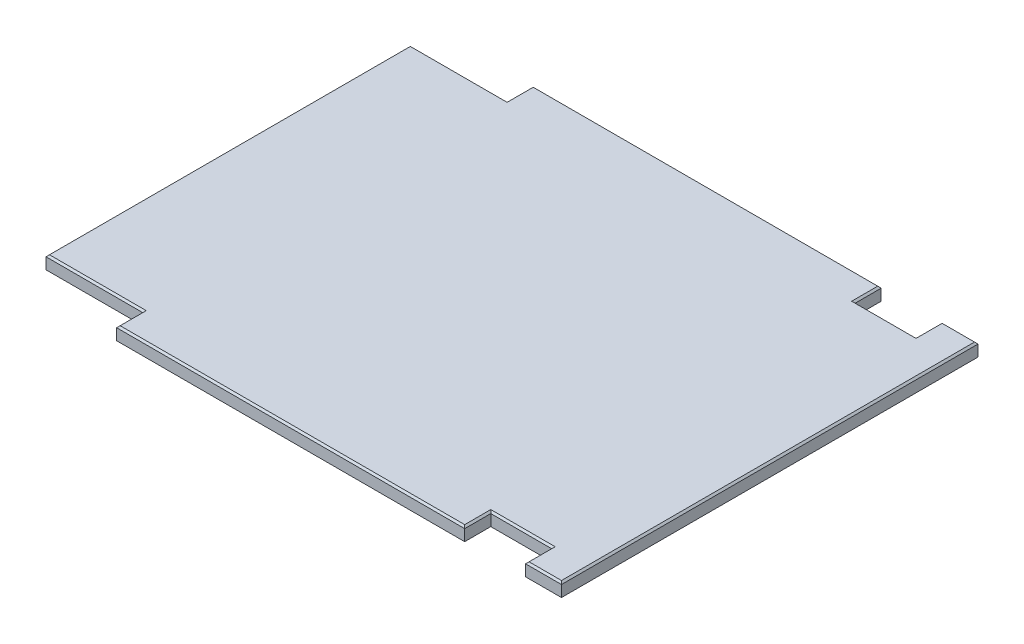
ISO-10303-21;
HEADER;
FILE_DESCRIPTION(('STEP AP214'),'2;1');
FILE_NAME('part.step','',(''),(''),'','','');
FILE_SCHEMA(('AUTOMOTIVE_DESIGN { 1 0 10303 214 1 1 1 1 }'));
ENDSEC;
DATA;
#1=APPLICATION_CONTEXT('core data for automotive mechanical design processes');
#2=APPLICATION_PROTOCOL_DEFINITION('international standard','automotive_design',2000,#1);
#3=PRODUCT_CONTEXT('',#1,'mechanical');
#4=PRODUCT('Part','Part','',(#3));
#5=PRODUCT_RELATED_PRODUCT_CATEGORY('part','',(#4));
#6=PRODUCT_DEFINITION_FORMATION('','',#4);
#7=PRODUCT_DEFINITION_CONTEXT('part definition',#1,'design');
#8=PRODUCT_DEFINITION('design','',#6,#7);
#9=PRODUCT_DEFINITION_SHAPE('','',#8);
#10=(LENGTH_UNIT() NAMED_UNIT(*) SI_UNIT(.MILLI.,.METRE.));
#11=(NAMED_UNIT(*) PLANE_ANGLE_UNIT() SI_UNIT($,.RADIAN.));
#12=(NAMED_UNIT(*) SI_UNIT($,.STERADIAN.) SOLID_ANGLE_UNIT());
#13=UNCERTAINTY_MEASURE_WITH_UNIT(LENGTH_MEASURE(1.E-05),#10,'distance_accuracy_value','');
#14=(GEOMETRIC_REPRESENTATION_CONTEXT(3) GLOBAL_UNCERTAINTY_ASSIGNED_CONTEXT((#13)) GLOBAL_UNIT_ASSIGNED_CONTEXT((#10,
#11,#12)) REPRESENTATION_CONTEXT('',''));
#15=CARTESIAN_POINT('',(0.,0.,0.));
#16=DIRECTION('',(0.,0.,1.));
#17=DIRECTION('',(1.,0.,0.));
#18=AXIS2_PLACEMENT_3D('',#15,#16,#17);
#19=CARTESIAN_POINT('',(0.,19.05,0.));
#20=DIRECTION('',(0.,0.,-1.));
#21=DIRECTION('',(-1.,0.,0.));
#22=AXIS2_PLACEMENT_3D('',#19,#20,#21);
#23=PLANE('',#22);
#24=DIRECTION('',(0.,-1.,0.));
#25=VECTOR('',#24,1.);
#26=CARTESIAN_POINT('',(790.575,19.05,0.));
#27=LINE('',#26,#25);
#28=CARTESIAN_POINT('',(790.575,16.51,0.));
#29=VERTEX_POINT('',#28);
#30=CARTESIAN_POINT('',(790.575,0.,0.));
#31=VERTEX_POINT('',#30);
#32=EDGE_CURVE('E243',#29,#31,#27,.T.);
#33=ORIENTED_EDGE('',*,*,#32,.F.);
#34=DIRECTION('',(-1.,0.,0.));
#35=VECTOR('',#34,1.);
#36=CARTESIAN_POINT('',(0.,16.51,0.));
#37=LINE('',#36,#35);
#38=CARTESIAN_POINT('',(738.1875,16.51,0.));
#39=VERTEX_POINT('',#38);
#40=EDGE_CURVE('E65',#29,#39,#37,.T.);
#41=ORIENTED_EDGE('',*,*,#40,.T.);
#42=DIRECTION('',(0.,1.,0.));
#43=VECTOR('',#42,1.);
#44=CARTESIAN_POINT('',(738.1875,0.,0.));
#45=LINE('',#44,#43);
#46=CARTESIAN_POINT('',(738.1875,0.,0.));
#47=VERTEX_POINT('',#46);
#48=EDGE_CURVE('E356',#47,#39,#45,.T.);
#49=ORIENTED_EDGE('',*,*,#48,.F.);
#50=DIRECTION('',(1.,0.,0.));
#51=VECTOR('',#50,1.);
#52=CARTESIAN_POINT('',(0.,0.,0.));
#53=LINE('',#52,#51);
#54=EDGE_CURVE('E395',#47,#31,#53,.T.);
#55=ORIENTED_EDGE('',*,*,#54,.T.);
#56=EDGE_LOOP('',(#33,#41,#49,#55));
#57=FACE_BOUND('',#56,.T.);
#58=ADVANCED_FACE('F40',(#57),#23,.F.);
#59=CARTESIAN_POINT('',(0.,19.05,-608.0125));
#60=DIRECTION('',(0.,0.,1.));
#61=DIRECTION('',(1.,0.,0.));
#62=AXIS2_PLACEMENT_3D('',#59,#60,#61);
#63=PLANE('',#62);
#64=DIRECTION('',(0.,1.,0.));
#65=VECTOR('',#64,1.);
#66=CARTESIAN_POINT('',(738.1875,0.,-608.0125));
#67=LINE('',#66,#65);
#68=CARTESIAN_POINT('',(738.1875,0.,-608.0125));
#69=VERTEX_POINT('',#68);
#70=CARTESIAN_POINT('',(738.1875,16.51,-608.0125));
#71=VERTEX_POINT('',#70);
#72=EDGE_CURVE('E383',#69,#71,#67,.T.);
#73=ORIENTED_EDGE('',*,*,#72,.T.);
#74=DIRECTION('',(1.,0.,0.));
#75=VECTOR('',#74,1.);
#76=CARTESIAN_POINT('',(0.,16.51,-608.0125));
#77=LINE('',#76,#75);
#78=CARTESIAN_POINT('',(790.575,16.51,-608.0125));
#79=VERTEX_POINT('',#78);
#80=EDGE_CURVE('E300',#71,#79,#77,.T.);
#81=ORIENTED_EDGE('',*,*,#80,.T.);
#82=DIRECTION('',(0.,-1.,0.));
#83=VECTOR('',#82,1.);
#84=CARTESIAN_POINT('',(790.575,19.05,-608.0125));
#85=LINE('',#84,#83);
#86=CARTESIAN_POINT('',(790.575,0.,-608.0125));
#87=VERTEX_POINT('',#86);
#88=EDGE_CURVE('E236',#79,#87,#85,.T.);
#89=ORIENTED_EDGE('',*,*,#88,.T.);
#90=DIRECTION('',(-1.,0.,0.));
#91=VECTOR('',#90,1.);
#92=CARTESIAN_POINT('',(0.,0.,-608.0125));
#93=LINE('',#92,#91);
#94=EDGE_CURVE('E232',#87,#69,#93,.T.);
#95=ORIENTED_EDGE('',*,*,#94,.T.);
#96=EDGE_LOOP('',(#73,#81,#89,#95));
#97=FACE_BOUND('',#96,.T.);
#98=ADVANCED_FACE('F469',(#97),#63,.F.);
#99=CARTESIAN_POINT('',(0.,19.05,0.));
#100=DIRECTION('',(1.,0.,0.));
#101=DIRECTION('',(0.,0.,-1.));
#102=AXIS2_PLACEMENT_3D('',#99,#100,#101);
#103=PLANE('',#102);
#104=DIRECTION('',(0.,1.,0.));
#105=VECTOR('',#104,1.);
#106=CARTESIAN_POINT('',(0.,0.,-38.1000000000009));
#107=LINE('',#106,#105);
#108=CARTESIAN_POINT('',(0.,0.,-38.1000000000009));
#109=VERTEX_POINT('',#108);
#110=CARTESIAN_POINT('',(0.,16.51,-38.1000000000009));
#111=VERTEX_POINT('',#110);
#112=EDGE_CURVE('E374',#109,#111,#107,.T.);
#113=ORIENTED_EDGE('',*,*,#112,.T.);
#114=DIRECTION('',(0.,0.,-1.));
#115=VECTOR('',#114,1.);
#116=CARTESIAN_POINT('',(0.,16.51,0.));
#117=LINE('',#116,#115);
#118=CARTESIAN_POINT('',(0.,16.51,-569.912499999999));
#119=VERTEX_POINT('',#118);
#120=EDGE_CURVE('E287',#111,#119,#117,.T.);
#121=ORIENTED_EDGE('',*,*,#120,.T.);
#122=DIRECTION('',(0.,1.,0.));
#123=VECTOR('',#122,1.);
#124=CARTESIAN_POINT('',(0.,0.,-569.912499999999));
#125=LINE('',#124,#123);
#126=CARTESIAN_POINT('',(0.,0.,-569.912499999999));
#127=VERTEX_POINT('',#126);
#128=EDGE_CURVE('E226',#127,#119,#125,.T.);
#129=ORIENTED_EDGE('',*,*,#128,.F.);
#130=DIRECTION('',(0.,0.,1.));
#131=VECTOR('',#130,1.);
#132=CARTESIAN_POINT('',(0.,0.,0.));
#133=LINE('',#132,#131);
#134=EDGE_CURVE('E387',#127,#109,#133,.T.);
#135=ORIENTED_EDGE('',*,*,#134,.T.);
#136=EDGE_LOOP('',(#113,#121,#129,#135));
#137=FACE_BOUND('',#136,.T.);
#138=ADVANCED_FACE('F485',(#137),#103,.F.);
#139=DIRECTION('',(0.,1.,0.));
#140=VECTOR('',#139,1.);
#141=CARTESIAN_POINT('',(649.2875,0.,5.55111512312578E-13));
#142=LINE('',#141,#140);
#143=CARTESIAN_POINT('',(649.2875,0.,0.));
#144=VERTEX_POINT('',#143);
#145=CARTESIAN_POINT('',(649.2875,16.51,5.55111512312578E-13));
#146=VERTEX_POINT('',#145);
#147=EDGE_CURVE('E361',#144,#146,#142,.T.);
#148=ORIENTED_EDGE('',*,*,#147,.T.);
#149=DIRECTION('',(-1.,0.,0.));
#150=VECTOR('',#149,1.);
#151=CARTESIAN_POINT('',(0.,16.51,0.));
#152=LINE('',#151,#150);
#153=CARTESIAN_POINT('',(141.2875,16.51,1.11022302462516E-13));
#154=VERTEX_POINT('',#153);
#155=EDGE_CURVE('E281',#146,#154,#152,.T.);
#156=ORIENTED_EDGE('',*,*,#155,.T.);
#157=DIRECTION('',(0.,1.,0.));
#158=VECTOR('',#157,1.);
#159=CARTESIAN_POINT('',(141.2875,0.,1.11022302462516E-13));
#160=LINE('',#159,#158);
#161=CARTESIAN_POINT('',(141.2875,0.,1.11022302462516E-13));
#162=VERTEX_POINT('',#161);
#163=EDGE_CURVE('E406',#162,#154,#160,.T.);
#164=ORIENTED_EDGE('',*,*,#163,.F.);
#165=EDGE_CURVE('E238',#162,#144,#53,.T.);
#166=ORIENTED_EDGE('',*,*,#165,.T.);
#167=EDGE_LOOP('',(#148,#156,#164,#166));
#168=FACE_BOUND('',#167,.T.);
#169=ADVANCED_FACE('F404',(#168),#23,.F.);
#170=CARTESIAN_POINT('',(790.575,19.05,0.));
#171=DIRECTION('',(-1.,0.,0.));
#172=DIRECTION('',(0.,0.,1.));
#173=AXIS2_PLACEMENT_3D('',#170,#171,#172);
#174=PLANE('',#173);
#175=ORIENTED_EDGE('',*,*,#88,.F.);
#176=DIRECTION('',(0.,0.,1.));
#177=VECTOR('',#176,1.);
#178=CARTESIAN_POINT('',(790.575,16.51,0.));
#179=LINE('',#178,#177);
#180=EDGE_CURVE('E302',#79,#29,#179,.T.);
#181=ORIENTED_EDGE('',*,*,#180,.T.);
#182=ORIENTED_EDGE('',*,*,#32,.T.);
#183=DIRECTION('',(0.,0.,-1.));
#184=VECTOR('',#183,1.);
#185=CARTESIAN_POINT('',(790.575,0.,0.));
#186=LINE('',#185,#184);
#187=EDGE_CURVE('E233',#31,#87,#186,.T.);
#188=ORIENTED_EDGE('',*,*,#187,.T.);
#189=EDGE_LOOP('',(#175,#181,#182,#188));
#190=FACE_BOUND('',#189,.T.);
#191=ADVANCED_FACE('F475',(#190),#174,.F.);
#192=DIRECTION('',(0.,1.,0.));
#193=VECTOR('',#192,1.);
#194=CARTESIAN_POINT('',(141.2875,0.,-608.0125));
#195=LINE('',#194,#193);
#196=CARTESIAN_POINT('',(141.2875,0.,-608.0125));
#197=VERTEX_POINT('',#196);
#198=CARTESIAN_POINT('',(141.2875,16.51,-608.0125));
#199=VERTEX_POINT('',#198);
#200=EDGE_CURVE('E203',#197,#199,#195,.T.);
#201=ORIENTED_EDGE('',*,*,#200,.T.);
#202=DIRECTION('',(1.,0.,0.));
#203=VECTOR('',#202,1.);
#204=CARTESIAN_POINT('',(0.,16.51,-608.0125));
#205=LINE('',#204,#203);
#206=CARTESIAN_POINT('',(649.2875,16.51,-608.012500000001));
#207=VERTEX_POINT('',#206);
#208=EDGE_CURVE('E292',#199,#207,#205,.T.);
#209=ORIENTED_EDGE('',*,*,#208,.T.);
#210=DIRECTION('',(0.,1.,0.));
#211=VECTOR('',#210,1.);
#212=CARTESIAN_POINT('',(649.2875,0.,-608.012500000001));
#213=LINE('',#212,#211);
#214=CARTESIAN_POINT('',(649.2875,0.,-608.012500000001));
#215=VERTEX_POINT('',#214);
#216=EDGE_CURVE('E231',#215,#207,#213,.T.);
#217=ORIENTED_EDGE('',*,*,#216,.F.);
#218=EDGE_CURVE('E223',#215,#197,#93,.T.);
#219=ORIENTED_EDGE('',*,*,#218,.T.);
#220=EDGE_LOOP('',(#201,#209,#217,#219));
#221=FACE_BOUND('',#220,.T.);
#222=ADVANCED_FACE('F229',(#221),#63,.F.);
#223=CARTESIAN_POINT('',(0.,19.05,0.));
#224=DIRECTION('',(0.,-1.,0.));
#225=DIRECTION('',(0.,0.,-1.));
#226=AXIS2_PLACEMENT_3D('',#223,#224,#225);
#227=PLANE('',#226);
#228=DIRECTION('',(1.,0.,0.));
#229=VECTOR('',#228,1.);
#230=CARTESIAN_POINT('',(0.,19.05,-2.5400000000001));
#231=LINE('',#230,#229);
#232=CARTESIAN_POINT('',(143.8275,19.05,-2.5400000000001));
#233=VERTEX_POINT('',#232);
#234=CARTESIAN_POINT('',(646.7475,19.05,-2.5400000000001));
#235=VERTEX_POINT('',#234);
#236=EDGE_CURVE('E276',#233,#235,#231,.T.);
#237=ORIENTED_EDGE('',*,*,#236,.T.);
#238=DIRECTION('',(0.,0.,-1.));
#239=VECTOR('',#238,1.);
#240=CARTESIAN_POINT('',(646.7475,19.05,0.));
#241=LINE('',#240,#239);
#242=CARTESIAN_POINT('',(646.7475,19.05,-40.6400000000009));
#243=VERTEX_POINT('',#242);
#244=EDGE_CURVE('E278',#235,#243,#241,.T.);
#245=ORIENTED_EDGE('',*,*,#244,.T.);
#246=DIRECTION('',(1.,0.,0.));
#247=VECTOR('',#246,1.);
#248=CARTESIAN_POINT('',(0.,19.05,-40.6400000000001));
#249=LINE('',#248,#247);
#250=CARTESIAN_POINT('',(740.7275,19.05,-40.640000000001));
#251=VERTEX_POINT('',#250);
#252=EDGE_CURVE('E248',#243,#251,#249,.T.);
#253=ORIENTED_EDGE('',*,*,#252,.T.);
#254=DIRECTION('',(0.,0.,1.));
#255=VECTOR('',#254,1.);
#256=CARTESIAN_POINT('',(740.7275,19.05,0.));
#257=LINE('',#256,#255);
#258=CARTESIAN_POINT('',(740.7275,19.05,-2.5400000000001));
#259=VERTEX_POINT('',#258);
#260=EDGE_CURVE('E250',#251,#259,#257,.T.);
#261=ORIENTED_EDGE('',*,*,#260,.T.);
#262=DIRECTION('',(1.,0.,0.));
#263=VECTOR('',#262,1.);
#264=CARTESIAN_POINT('',(0.,19.05,-2.5400000000001));
#265=LINE('',#264,#263);
#266=CARTESIAN_POINT('',(788.035,19.05,-2.5400000000001));
#267=VERTEX_POINT('',#266);
#268=EDGE_CURVE('E252',#259,#267,#265,.T.);
#269=ORIENTED_EDGE('',*,*,#268,.T.);
#270=DIRECTION('',(0.,0.,-1.));
#271=VECTOR('',#270,1.);
#272=CARTESIAN_POINT('',(788.035,19.05,0.));
#273=LINE('',#272,#271);
#274=CARTESIAN_POINT('',(788.035,19.05,-605.4725));
#275=VERTEX_POINT('',#274);
#276=EDGE_CURVE('E254',#267,#275,#273,.T.);
#277=ORIENTED_EDGE('',*,*,#276,.T.);
#278=DIRECTION('',(-1.,0.,0.));
#279=VECTOR('',#278,1.);
#280=CARTESIAN_POINT('',(0.,19.05,-605.4725));
#281=LINE('',#280,#279);
#282=CARTESIAN_POINT('',(740.7275,19.05,-605.4725));
#283=VERTEX_POINT('',#282);
#284=EDGE_CURVE('E256',#275,#283,#281,.T.);
#285=ORIENTED_EDGE('',*,*,#284,.T.);
#286=DIRECTION('',(0.,0.,1.));
#287=VECTOR('',#286,1.);
#288=CARTESIAN_POINT('',(740.7275,19.05,0.));
#289=LINE('',#288,#287);
#290=CARTESIAN_POINT('',(740.7275,19.05,-567.372499999999));
#291=VERTEX_POINT('',#290);
#292=EDGE_CURVE('E258',#283,#291,#289,.T.);
#293=ORIENTED_EDGE('',*,*,#292,.T.);
#294=DIRECTION('',(-1.,0.,0.));
#295=VECTOR('',#294,1.);
#296=CARTESIAN_POINT('',(7.08560194644698E-13,19.05,-567.3725));
#297=LINE('',#296,#295);
#298=CARTESIAN_POINT('',(646.7475,19.05,-567.372499999999));
#299=VERTEX_POINT('',#298);
#300=EDGE_CURVE('E260',#291,#299,#297,.T.);
#301=ORIENTED_EDGE('',*,*,#300,.T.);
#302=DIRECTION('',(0.,0.,-1.));
#303=VECTOR('',#302,1.);
#304=CARTESIAN_POINT('',(646.7475,19.05,0.));
#305=LINE('',#304,#303);
#306=CARTESIAN_POINT('',(646.7475,19.05,-605.4725));
#307=VERTEX_POINT('',#306);
#308=EDGE_CURVE('E262',#299,#307,#305,.T.);
#309=ORIENTED_EDGE('',*,*,#308,.T.);
#310=DIRECTION('',(-1.,0.,0.));
#311=VECTOR('',#310,1.);
#312=CARTESIAN_POINT('',(0.,19.05,-605.4725));
#313=LINE('',#312,#311);
#314=CARTESIAN_POINT('',(143.8275,19.05,-605.4725));
#315=VERTEX_POINT('',#314);
#316=EDGE_CURVE('E264',#307,#315,#313,.T.);
#317=ORIENTED_EDGE('',*,*,#316,.T.);
#318=DIRECTION('',(0.,0.,1.));
#319=VECTOR('',#318,1.);
#320=CARTESIAN_POINT('',(143.8275,19.05,0.));
#321=LINE('',#320,#319);
#322=CARTESIAN_POINT('',(143.8275,19.05,-567.372499999999));
#323=VERTEX_POINT('',#322);
#324=EDGE_CURVE('E266',#315,#323,#321,.T.);
#325=ORIENTED_EDGE('',*,*,#324,.T.);
#326=DIRECTION('',(-1.,0.,0.));
#327=VECTOR('',#326,1.);
#328=CARTESIAN_POINT('',(-4.45835628091046E-13,19.05,-567.372499999999));
#329=LINE('',#328,#327);
#330=CARTESIAN_POINT('',(2.5400000000001,19.05,-567.372499999999));
#331=VERTEX_POINT('',#330);
#332=EDGE_CURVE('E268',#323,#331,#329,.T.);
#333=ORIENTED_EDGE('',*,*,#332,.T.);
#334=DIRECTION('',(0.,0.,1.));
#335=VECTOR('',#334,1.);
#336=CARTESIAN_POINT('',(2.5400000000001,19.05,0.));
#337=LINE('',#336,#335);
#338=CARTESIAN_POINT('',(2.5400000000001,19.05,-40.640000000001));
#339=VERTEX_POINT('',#338);
#340=EDGE_CURVE('E270',#331,#339,#337,.T.);
#341=ORIENTED_EDGE('',*,*,#340,.T.);
#342=DIRECTION('',(1.,0.,0.));
#343=VECTOR('',#342,1.);
#344=CARTESIAN_POINT('',(0.,19.05,-40.640000000001));
#345=LINE('',#344,#343);
#346=CARTESIAN_POINT('',(143.8275,19.05,-40.6400000000009));
#347=VERTEX_POINT('',#346);
#348=EDGE_CURVE('E272',#339,#347,#345,.T.);
#349=ORIENTED_EDGE('',*,*,#348,.T.);
#350=DIRECTION('',(0.,0.,1.));
#351=VECTOR('',#350,1.);
#352=CARTESIAN_POINT('',(143.8275,19.05,0.));
#353=LINE('',#352,#351);
#354=EDGE_CURVE('E274',#347,#233,#353,.T.);
#355=ORIENTED_EDGE('',*,*,#354,.T.);
#356=EDGE_LOOP('',(#237,#245,#253,#261,#269,#277,#285,#293,#301,#309,#317,#325,#333,#341,#349,#355));
#357=FACE_BOUND('',#356,.T.);
#358=ADVANCED_FACE('F446',(#357),#227,.F.);
#359=CARTESIAN_POINT('',(0.,0.,0.));
#360=DIRECTION('',(0.,-1.,0.));
#361=DIRECTION('',(0.,0.,-1.));
#362=AXIS2_PLACEMENT_3D('',#359,#360,#361);
#363=PLANE('',#362);
#364=DIRECTION('',(0.,0.,-1.));
#365=VECTOR('',#364,1.);
#366=CARTESIAN_POINT('',(738.1875,0.,-38.1000000000009));
#367=LINE('',#366,#365);
#368=CARTESIAN_POINT('',(738.1875,0.,-38.1000000000009));
#369=VERTEX_POINT('',#368);
#370=EDGE_CURVE('E365',#47,#369,#367,.T.);
#371=ORIENTED_EDGE('',*,*,#370,.T.);
#372=DIRECTION('',(-1.,0.,0.));
#373=VECTOR('',#372,1.);
#374=CARTESIAN_POINT('',(738.1875,0.,-38.1000000000009));
#375=LINE('',#374,#373);
#376=CARTESIAN_POINT('',(649.2875,0.,-38.1000000000008));
#377=VERTEX_POINT('',#376);
#378=EDGE_CURVE('E371',#369,#377,#375,.T.);
#379=ORIENTED_EDGE('',*,*,#378,.T.);
#380=DIRECTION('',(0.,0.,1.));
#381=VECTOR('',#380,1.);
#382=CARTESIAN_POINT('',(649.2875,0.,-38.1000000000008));
#383=LINE('',#382,#381);
#384=EDGE_CURVE('E367',#377,#144,#383,.T.);
#385=ORIENTED_EDGE('',*,*,#384,.T.);
#386=ORIENTED_EDGE('',*,*,#165,.F.);
#387=DIRECTION('',(0.,0.,-1.));
#388=VECTOR('',#387,1.);
#389=CARTESIAN_POINT('',(141.2875,0.,1.11022302462516E-13));
#390=LINE('',#389,#388);
#391=CARTESIAN_POINT('',(141.2875,0.,-38.1000000000008));
#392=VERTEX_POINT('',#391);
#393=EDGE_CURVE('E215',#162,#392,#390,.T.);
#394=ORIENTED_EDGE('',*,*,#393,.T.);
#395=DIRECTION('',(-1.,0.,0.));
#396=VECTOR('',#395,1.);
#397=CARTESIAN_POINT('',(0.,0.,-38.1000000000009));
#398=LINE('',#397,#396);
#399=EDGE_CURVE('E418',#392,#109,#398,.T.);
#400=ORIENTED_EDGE('',*,*,#399,.T.);
#401=ORIENTED_EDGE('',*,*,#134,.F.);
#402=DIRECTION('',(1.,0.,0.));
#403=VECTOR('',#402,1.);
#404=CARTESIAN_POINT('',(0.,0.,-569.912499999999));
#405=LINE('',#404,#403);
#406=CARTESIAN_POINT('',(141.2875,0.,-569.912499999999));
#407=VERTEX_POINT('',#406);
#408=EDGE_CURVE('E225',#127,#407,#405,.T.);
#409=ORIENTED_EDGE('',*,*,#408,.T.);
#410=DIRECTION('',(0.,0.,-1.));
#411=VECTOR('',#410,1.);
#412=CARTESIAN_POINT('',(141.2875,0.,-608.0125));
#413=LINE('',#412,#411);
#414=EDGE_CURVE('E207',#407,#197,#413,.T.);
#415=ORIENTED_EDGE('',*,*,#414,.T.);
#416=ORIENTED_EDGE('',*,*,#218,.F.);
#417=DIRECTION('',(0.,0.,1.));
#418=VECTOR('',#417,1.);
#419=CARTESIAN_POINT('',(649.2875,0.,-569.912499999999));
#420=LINE('',#419,#418);
#421=CARTESIAN_POINT('',(649.2875,0.,-569.912499999999));
#422=VERTEX_POINT('',#421);
#423=EDGE_CURVE('E378',#215,#422,#420,.T.);
#424=ORIENTED_EDGE('',*,*,#423,.T.);
#425=DIRECTION('',(1.,0.,0.));
#426=VECTOR('',#425,1.);
#427=CARTESIAN_POINT('',(738.1875,0.,-569.912499999999));
#428=LINE('',#427,#426);
#429=CARTESIAN_POINT('',(738.1875,0.,-569.912499999999));
#430=VERTEX_POINT('',#429);
#431=EDGE_CURVE('E380',#422,#430,#428,.T.);
#432=ORIENTED_EDGE('',*,*,#431,.T.);
#433=DIRECTION('',(0.,0.,-1.));
#434=VECTOR('',#433,1.);
#435=CARTESIAN_POINT('',(738.1875,0.,-569.912499999999));
#436=LINE('',#435,#434);
#437=EDGE_CURVE('E375',#430,#69,#436,.T.);
#438=ORIENTED_EDGE('',*,*,#437,.T.);
#439=ORIENTED_EDGE('',*,*,#94,.F.);
#440=ORIENTED_EDGE('',*,*,#187,.F.);
#441=ORIENTED_EDGE('',*,*,#54,.F.);
#442=EDGE_LOOP('',(#371,#379,#385,#386,#394,#400,#401,#409,#415,#416,#424,#432,#438,#439,#440,#441));
#443=FACE_BOUND('',#442,.T.);
#444=ADVANCED_FACE('F221',(#443),#363,.T.);
#445=CARTESIAN_POINT('',(738.1875,0.,-569.912499999999));
#446=DIRECTION('',(1.,0.,0.));
#447=DIRECTION('',(0.,0.,-1.));
#448=AXIS2_PLACEMENT_3D('',#445,#446,#447);
#449=PLANE('',#448);
#450=DIRECTION('',(0.,1.,0.));
#451=VECTOR('',#450,1.);
#452=CARTESIAN_POINT('',(738.1875,0.,-569.912499999999));
#453=LINE('',#452,#451);
#454=CARTESIAN_POINT('',(738.1875,16.51,-569.912499999999));
#455=VERTEX_POINT('',#454);
#456=EDGE_CURVE('E384',#430,#455,#453,.T.);
#457=ORIENTED_EDGE('',*,*,#456,.T.);
#458=DIRECTION('',(0.,0.,-1.));
#459=VECTOR('',#458,1.);
#460=CARTESIAN_POINT('',(738.1875,16.51,-569.912499999999));
#461=LINE('',#460,#459);
#462=EDGE_CURVE('E298',#455,#71,#461,.T.);
#463=ORIENTED_EDGE('',*,*,#462,.T.);
#464=ORIENTED_EDGE('',*,*,#72,.F.);
#465=ORIENTED_EDGE('',*,*,#437,.F.);
#466=EDGE_LOOP('',(#457,#463,#464,#465));
#467=FACE_BOUND('',#466,.T.);
#468=ADVANCED_FACE('F466',(#467),#449,.F.);
#469=CARTESIAN_POINT('',(738.1875,0.,-569.912499999999));
#470=DIRECTION('',(0.,0.,1.));
#471=DIRECTION('',(1.,0.,0.));
#472=AXIS2_PLACEMENT_3D('',#469,#470,#471);
#473=PLANE('',#472);
#474=DIRECTION('',(0.,1.,0.));
#475=VECTOR('',#474,1.);
#476=CARTESIAN_POINT('',(649.2875,0.,-569.912499999999));
#477=LINE('',#476,#475);
#478=CARTESIAN_POINT('',(649.2875,16.51,-569.912499999999));
#479=VERTEX_POINT('',#478);
#480=EDGE_CURVE('E388',#422,#479,#477,.T.);
#481=ORIENTED_EDGE('',*,*,#480,.T.);
#482=DIRECTION('',(1.,0.,0.));
#483=VECTOR('',#482,1.);
#484=CARTESIAN_POINT('',(738.1875,16.51,-569.912499999999));
#485=LINE('',#484,#483);
#486=EDGE_CURVE('E296',#479,#455,#485,.T.);
#487=ORIENTED_EDGE('',*,*,#486,.T.);
#488=ORIENTED_EDGE('',*,*,#456,.F.);
#489=ORIENTED_EDGE('',*,*,#431,.F.);
#490=EDGE_LOOP('',(#481,#487,#488,#489));
#491=FACE_BOUND('',#490,.T.);
#492=ADVANCED_FACE('F463',(#491),#473,.F.);
#493=CARTESIAN_POINT('',(649.2875,0.,-569.912499999999));
#494=DIRECTION('',(-1.,0.,0.));
#495=DIRECTION('',(0.,0.,1.));
#496=AXIS2_PLACEMENT_3D('',#493,#494,#495);
#497=PLANE('',#496);
#498=ORIENTED_EDGE('',*,*,#216,.T.);
#499=DIRECTION('',(0.,0.,1.));
#500=VECTOR('',#499,1.);
#501=CARTESIAN_POINT('',(649.2875,16.51,-569.912499999999));
#502=LINE('',#501,#500);
#503=EDGE_CURVE('E294',#207,#479,#502,.T.);
#504=ORIENTED_EDGE('',*,*,#503,.T.);
#505=ORIENTED_EDGE('',*,*,#480,.F.);
#506=ORIENTED_EDGE('',*,*,#423,.F.);
#507=EDGE_LOOP('',(#498,#504,#505,#506));
#508=FACE_BOUND('',#507,.T.);
#509=ADVANCED_FACE('F455',(#508),#497,.F.);
#510=CARTESIAN_POINT('',(141.2875,0.,-608.0125));
#511=DIRECTION('',(1.,0.,0.));
#512=DIRECTION('',(0.,0.,-1.));
#513=AXIS2_PLACEMENT_3D('',#510,#511,#512);
#514=PLANE('',#513);
#515=DIRECTION('',(0.,1.,0.));
#516=VECTOR('',#515,1.);
#517=CARTESIAN_POINT('',(141.2875,0.,-569.912499999999));
#518=LINE('',#517,#516);
#519=CARTESIAN_POINT('',(141.2875,16.51,-569.912499999999));
#520=VERTEX_POINT('',#519);
#521=EDGE_CURVE('E214',#407,#520,#518,.T.);
#522=ORIENTED_EDGE('',*,*,#521,.T.);
#523=DIRECTION('',(0.,0.,-1.));
#524=VECTOR('',#523,1.);
#525=CARTESIAN_POINT('',(141.2875,16.51,-608.0125));
#526=LINE('',#525,#524);
#527=EDGE_CURVE('E210',#520,#199,#526,.T.);
#528=ORIENTED_EDGE('',*,*,#527,.T.);
#529=ORIENTED_EDGE('',*,*,#200,.F.);
#530=ORIENTED_EDGE('',*,*,#414,.F.);
#531=EDGE_LOOP('',(#522,#528,#529,#530));
#532=FACE_BOUND('',#531,.T.);
#533=ADVANCED_FACE('F206',(#532),#514,.F.);
#534=CARTESIAN_POINT('',(0.,0.,-569.912499999999));
#535=DIRECTION('',(0.,0.,1.));
#536=DIRECTION('',(1.,0.,0.));
#537=AXIS2_PLACEMENT_3D('',#534,#535,#536);
#538=PLANE('',#537);
#539=ORIENTED_EDGE('',*,*,#128,.T.);
#540=DIRECTION('',(1.,0.,0.));
#541=VECTOR('',#540,1.);
#542=CARTESIAN_POINT('',(0.,16.51,-569.912499999999));
#543=LINE('',#542,#541);
#544=EDGE_CURVE('E289',#119,#520,#543,.T.);
#545=ORIENTED_EDGE('',*,*,#544,.T.);
#546=ORIENTED_EDGE('',*,*,#521,.F.);
#547=ORIENTED_EDGE('',*,*,#408,.F.);
#548=EDGE_LOOP('',(#539,#545,#546,#547));
#549=FACE_BOUND('',#548,.T.);
#550=ADVANCED_FACE('F432',(#549),#538,.F.);
#551=CARTESIAN_POINT('',(0.,0.,-38.1000000000009));
#552=DIRECTION('',(0.,0.,-1.));
#553=DIRECTION('',(-1.,0.,0.));
#554=AXIS2_PLACEMENT_3D('',#551,#552,#553);
#555=PLANE('',#554);
#556=DIRECTION('',(0.,1.,0.));
#557=VECTOR('',#556,1.);
#558=CARTESIAN_POINT('',(141.2875,0.,-38.1000000000008));
#559=LINE('',#558,#557);
#560=CARTESIAN_POINT('',(141.2875,16.51,-38.1000000000008));
#561=VERTEX_POINT('',#560);
#562=EDGE_CURVE('E422',#392,#561,#559,.T.);
#563=ORIENTED_EDGE('',*,*,#562,.T.);
#564=DIRECTION('',(-1.,0.,0.));
#565=VECTOR('',#564,1.);
#566=CARTESIAN_POINT('',(0.,16.51,-38.1000000000009));
#567=LINE('',#566,#565);
#568=EDGE_CURVE('E285',#561,#111,#567,.T.);
#569=ORIENTED_EDGE('',*,*,#568,.T.);
#570=ORIENTED_EDGE('',*,*,#112,.F.);
#571=ORIENTED_EDGE('',*,*,#399,.F.);
#572=EDGE_LOOP('',(#563,#569,#570,#571));
#573=FACE_BOUND('',#572,.T.);
#574=ADVANCED_FACE('F654',(#573),#555,.F.);
#575=CARTESIAN_POINT('',(141.2875,0.,1.11022302462516E-13));
#576=DIRECTION('',(1.,0.,0.));
#577=DIRECTION('',(0.,0.,-1.));
#578=AXIS2_PLACEMENT_3D('',#575,#576,#577);
#579=PLANE('',#578);
#580=ORIENTED_EDGE('',*,*,#163,.T.);
#581=DIRECTION('',(0.,0.,-1.));
#582=VECTOR('',#581,1.);
#583=CARTESIAN_POINT('',(141.2875,16.51,1.11022302462516E-13));
#584=LINE('',#583,#582);
#585=EDGE_CURVE('E283',#154,#561,#584,.T.);
#586=ORIENTED_EDGE('',*,*,#585,.T.);
#587=ORIENTED_EDGE('',*,*,#562,.F.);
#588=ORIENTED_EDGE('',*,*,#393,.F.);
#589=EDGE_LOOP('',(#580,#586,#587,#588));
#590=FACE_BOUND('',#589,.T.);
#591=ADVANCED_FACE('F662',(#590),#579,.F.);
#592=CARTESIAN_POINT('',(738.1875,0.,-38.1000000000009));
#593=DIRECTION('',(0.,0.,-1.));
#594=DIRECTION('',(-1.,0.,0.));
#595=AXIS2_PLACEMENT_3D('',#592,#593,#594);
#596=PLANE('',#595);
#597=DIRECTION('',(0.,1.,0.));
#598=VECTOR('',#597,1.);
#599=CARTESIAN_POINT('',(738.1875,0.,-38.1000000000009));
#600=LINE('',#599,#598);
#601=CARTESIAN_POINT('',(738.1875,16.51,-38.1000000000009));
#602=VERTEX_POINT('',#601);
#603=EDGE_CURVE('E351',#369,#602,#600,.T.);
#604=ORIENTED_EDGE('',*,*,#603,.T.);
#605=DIRECTION('',(-1.,0.,0.));
#606=VECTOR('',#605,1.);
#607=CARTESIAN_POINT('',(738.1875,16.51,-38.1000000000009));
#608=LINE('',#607,#606);
#609=CARTESIAN_POINT('',(649.2875,16.51,-38.1000000000008));
#610=VERTEX_POINT('',#609);
#611=EDGE_CURVE('E11',#602,#610,#608,.T.);
#612=ORIENTED_EDGE('',*,*,#611,.T.);
#613=DIRECTION('',(0.,1.,0.));
#614=VECTOR('',#613,1.);
#615=CARTESIAN_POINT('',(649.2875,0.,-38.1000000000008));
#616=LINE('',#615,#614);
#617=EDGE_CURVE('E368',#377,#610,#616,.T.);
#618=ORIENTED_EDGE('',*,*,#617,.F.);
#619=ORIENTED_EDGE('',*,*,#378,.F.);
#620=EDGE_LOOP('',(#604,#612,#618,#619));
#621=FACE_BOUND('',#620,.T.);
#622=ADVANCED_FACE('F600',(#621),#596,.F.);
#623=CARTESIAN_POINT('',(738.1875,0.,-38.1000000000009));
#624=DIRECTION('',(1.,0.,0.));
#625=DIRECTION('',(0.,0.,-1.));
#626=AXIS2_PLACEMENT_3D('',#623,#624,#625);
#627=PLANE('',#626);
#628=ORIENTED_EDGE('',*,*,#48,.T.);
#629=DIRECTION('',(0.,0.,-1.));
#630=VECTOR('',#629,1.);
#631=CARTESIAN_POINT('',(738.1875,16.51,-38.1000000000009));
#632=LINE('',#631,#630);
#633=EDGE_CURVE('E50',#39,#602,#632,.T.);
#634=ORIENTED_EDGE('',*,*,#633,.T.);
#635=ORIENTED_EDGE('',*,*,#603,.F.);
#636=ORIENTED_EDGE('',*,*,#370,.F.);
#637=EDGE_LOOP('',(#628,#634,#635,#636));
#638=FACE_BOUND('',#637,.T.);
#639=ADVANCED_FACE('F476',(#638),#627,.F.);
#640=CARTESIAN_POINT('',(649.2875,0.,-38.1000000000008));
#641=DIRECTION('',(-1.,0.,0.));
#642=DIRECTION('',(0.,0.,1.));
#643=AXIS2_PLACEMENT_3D('',#640,#641,#642);
#644=PLANE('',#643);
#645=ORIENTED_EDGE('',*,*,#617,.T.);
#646=DIRECTION('',(0.,0.,1.));
#647=VECTOR('',#646,1.);
#648=CARTESIAN_POINT('',(649.2875,16.51,-38.1000000000008));
#649=LINE('',#648,#647);
#650=EDGE_CURVE('E245',#610,#146,#649,.T.);
#651=ORIENTED_EDGE('',*,*,#650,.T.);
#652=ORIENTED_EDGE('',*,*,#147,.F.);
#653=ORIENTED_EDGE('',*,*,#384,.F.);
#654=EDGE_LOOP('',(#645,#651,#652,#653));
#655=FACE_BOUND('',#654,.T.);
#656=ADVANCED_FACE('F412',(#655),#644,.F.);
#657=CARTESIAN_POINT('',(649.2875,16.51,-569.912499999999));
#658=DIRECTION('',(-0.707106781186532,-0.707106781186563,0.));
#659=DIRECTION('',(0.,0.,1.));
#660=AXIS2_PLACEMENT_3D('',#657,#658,#659);
#661=PLANE('',#660);
#662=DIRECTION('',(-0.577350269189634,0.577350269189609,0.577350269189634));
#663=VECTOR('',#662,1.);
#664=CARTESIAN_POINT('',(636.5875,29.2100000000001,-595.312499999999));
#665=LINE('',#664,#663);
#666=EDGE_CURVE('E345',#307,#207,#665,.F.);
#667=ORIENTED_EDGE('',*,*,#666,.F.);
#668=ORIENTED_EDGE('',*,*,#308,.F.);
#669=DIRECTION('',(-0.577350269189632,0.577350269189607,0.577350269189639));
#670=VECTOR('',#669,1.);
#671=CARTESIAN_POINT('',(649.2875,16.51,-569.912499999999));
#672=LINE('',#671,#670);
#673=EDGE_CURVE('E45',#479,#299,#672,.T.);
#674=ORIENTED_EDGE('',*,*,#673,.F.);
#675=ORIENTED_EDGE('',*,*,#503,.F.);
#676=EDGE_LOOP('',(#667,#668,#674,#675));
#677=FACE_BOUND('',#676,.T.);
#678=ADVANCED_FACE('F43',(#677),#661,.F.);
#679=CARTESIAN_POINT('',(738.1875,16.51,-569.912499999999));
#680=DIRECTION('',(0.,-0.707106781186568,0.707106781186527));
#681=DIRECTION('',(1.,0.,0.));
#682=AXIS2_PLACEMENT_3D('',#679,#680,#681);
#683=PLANE('',#682);
#684=ORIENTED_EDGE('',*,*,#673,.T.);
#685=ORIENTED_EDGE('',*,*,#300,.F.);
#686=DIRECTION('',(0.577350269189631,0.577350269189606,0.57735026918964));
#687=VECTOR('',#686,1.);
#688=CARTESIAN_POINT('',(738.1875,16.51,-569.912499999999));
#689=LINE('',#688,#687);
#690=EDGE_CURVE('E343',#455,#291,#689,.T.);
#691=ORIENTED_EDGE('',*,*,#690,.F.);
#692=ORIENTED_EDGE('',*,*,#486,.F.);
#693=EDGE_LOOP('',(#684,#685,#691,#692));
#694=FACE_BOUND('',#693,.T.);
#695=ADVANCED_FACE('F460',(#694),#683,.F.);
#696=CARTESIAN_POINT('',(0.,19.05,-605.4725));
#697=DIRECTION('',(0.,-0.707106781186563,0.707106781186532));
#698=DIRECTION('',(-1.,0.,0.));
#699=AXIS2_PLACEMENT_3D('',#696,#697,#698);
#700=PLANE('',#699);
#701=ORIENTED_EDGE('',*,*,#666,.T.);
#702=ORIENTED_EDGE('',*,*,#208,.F.);
#703=DIRECTION('',(0.577350269189634,0.577350269189609,0.577350269189634));
#704=VECTOR('',#703,1.);
#705=CARTESIAN_POINT('',(95.8849999999986,-28.8924999999993,-653.415000000001));
#706=LINE('',#705,#704);
#707=EDGE_CURVE('E340',#315,#199,#706,.F.);
#708=ORIENTED_EDGE('',*,*,#707,.F.);
#709=ORIENTED_EDGE('',*,*,#316,.F.);
#710=EDGE_LOOP('',(#701,#702,#708,#709));
#711=FACE_BOUND('',#710,.T.);
#712=ADVANCED_FACE('F452',(#711),#700,.F.);
#713=CARTESIAN_POINT('',(738.1875,16.51,-569.912499999999));
#714=DIRECTION('',(0.707106781186532,-0.707106781186563,0.));
#715=DIRECTION('',(0.,0.,-1.));
#716=AXIS2_PLACEMENT_3D('',#713,#714,#715);
#717=PLANE('',#716);
#718=ORIENTED_EDGE('',*,*,#690,.T.);
#719=ORIENTED_EDGE('',*,*,#292,.F.);
#720=DIRECTION('',(0.577350269189634,0.577350269189609,0.577350269189634));
#721=VECTOR('',#720,1.);
#722=CARTESIAN_POINT('',(493.818333333326,-227.859166666663,-852.381666666674));
#723=LINE('',#722,#721);
#724=EDGE_CURVE('E337',#71,#283,#723,.T.);
#725=ORIENTED_EDGE('',*,*,#724,.F.);
#726=ORIENTED_EDGE('',*,*,#462,.F.);
#727=EDGE_LOOP('',(#718,#719,#725,#726));
#728=FACE_BOUND('',#727,.T.);
#729=ADVANCED_FACE('F576',(#728),#717,.F.);
#730=CARTESIAN_POINT('',(141.2875,16.51,-608.0125));
#731=DIRECTION('',(0.707106781186532,-0.707106781186563,0.));
#732=DIRECTION('',(0.,0.,-1.));
#733=AXIS2_PLACEMENT_3D('',#730,#731,#732);
#734=PLANE('',#733);
#735=ORIENTED_EDGE('',*,*,#707,.T.);
#736=ORIENTED_EDGE('',*,*,#527,.F.);
#737=DIRECTION('',(0.577350269189634,0.577350269189609,0.577350269189634));
#738=VECTOR('',#737,1.);
#739=CARTESIAN_POINT('',(94.1916666666652,-30.5858333333326,-617.008333333334));
#740=LINE('',#739,#738);
#741=EDGE_CURVE('E334',#323,#520,#740,.F.);
#742=ORIENTED_EDGE('',*,*,#741,.F.);
#743=ORIENTED_EDGE('',*,*,#324,.F.);
#744=EDGE_LOOP('',(#735,#736,#742,#743));
#745=FACE_BOUND('',#744,.T.);
#746=ADVANCED_FACE('F451',(#745),#734,.F.);
#747=CARTESIAN_POINT('',(0.,19.05,-605.4725));
#748=DIRECTION('',(0.,-0.707106781186563,0.707106781186532));
#749=DIRECTION('',(-1.,0.,0.));
#750=AXIS2_PLACEMENT_3D('',#747,#748,#749);
#751=PLANE('',#750);
#752=ORIENTED_EDGE('',*,*,#724,.T.);
#753=ORIENTED_EDGE('',*,*,#284,.F.);
#754=DIRECTION('',(-0.577350269189634,0.577350269189609,0.577350269189634));
#755=VECTOR('',#754,1.);
#756=CARTESIAN_POINT('',(586.210833333328,220.874166666664,-403.648333333327));
#757=LINE('',#756,#755);
#758=EDGE_CURVE('E331',#79,#275,#757,.T.);
#759=ORIENTED_EDGE('',*,*,#758,.F.);
#760=ORIENTED_EDGE('',*,*,#80,.F.);
#761=EDGE_LOOP('',(#752,#753,#759,#760));
#762=FACE_BOUND('',#761,.T.);
#763=ADVANCED_FACE('F564',(#762),#751,.F.);
#764=CARTESIAN_POINT('',(0.,16.51,-569.912499999999));
#765=DIRECTION('',(0.,-0.707106781186563,0.707106781186532));
#766=DIRECTION('',(1.,0.,0.));
#767=AXIS2_PLACEMENT_3D('',#764,#765,#766);
#768=PLANE('',#767);
#769=ORIENTED_EDGE('',*,*,#741,.T.);
#770=ORIENTED_EDGE('',*,*,#544,.F.);
#771=DIRECTION('',(0.577350269189634,0.577350269189609,0.577350269189634));
#772=VECTOR('',#771,1.);
#773=CARTESIAN_POINT('',(0.,16.51,-569.912499999999));
#774=LINE('',#773,#772);
#775=EDGE_CURVE('E328',#331,#119,#774,.F.);
#776=ORIENTED_EDGE('',*,*,#775,.F.);
#777=ORIENTED_EDGE('',*,*,#332,.F.);
#778=EDGE_LOOP('',(#769,#770,#776,#777));
#779=FACE_BOUND('',#778,.T.);
#780=ADVANCED_FACE('F436',(#779),#768,.F.);
#781=CARTESIAN_POINT('',(788.035,19.05,0.));
#782=DIRECTION('',(-0.707106781186532,-0.707106781186563,0.));
#783=DIRECTION('',(0.,0.,-1.));
#784=AXIS2_PLACEMENT_3D('',#781,#782,#783);
#785=PLANE('',#784);
#786=ORIENTED_EDGE('',*,*,#758,.T.);
#787=ORIENTED_EDGE('',*,*,#276,.F.);
#788=DIRECTION('',(-0.577350269189634,0.577350269189609,-0.577350269189634));
#789=VECTOR('',#788,1.);
#790=CARTESIAN_POINT('',(525.356666666659,281.72833333333,-265.218333333341));
#791=LINE('',#790,#789);
#792=EDGE_CURVE('E325',#29,#267,#791,.T.);
#793=ORIENTED_EDGE('',*,*,#792,.F.);
#794=ORIENTED_EDGE('',*,*,#180,.F.);
#795=EDGE_LOOP('',(#786,#787,#793,#794));
#796=FACE_BOUND('',#795,.T.);
#797=ADVANCED_FACE('F552',(#796),#785,.F.);
#798=CARTESIAN_POINT('',(2.5400000000001,19.05,0.));
#799=DIRECTION('',(0.707106781186532,-0.707106781186563,0.));
#800=DIRECTION('',(0.,0.,1.));
#801=AXIS2_PLACEMENT_3D('',#798,#799,#800);
#802=PLANE('',#801);
#803=ORIENTED_EDGE('',*,*,#775,.T.);
#804=ORIENTED_EDGE('',*,*,#120,.F.);
#805=DIRECTION('',(0.577350269189634,0.577350269189609,-0.577350269189634));
#806=VECTOR('',#805,1.);
#807=CARTESIAN_POINT('',(-11.0066666666673,5.50333333333319,-27.0933333333336));
#808=LINE('',#807,#806);
#809=EDGE_CURVE('E322',#339,#111,#808,.F.);
#810=ORIENTED_EDGE('',*,*,#809,.F.);
#811=ORIENTED_EDGE('',*,*,#340,.F.);
#812=EDGE_LOOP('',(#803,#804,#810,#811));
#813=FACE_BOUND('',#812,.T.);
#814=ADVANCED_FACE('F442',(#813),#802,.F.);
#815=CARTESIAN_POINT('',(0.,19.05,-2.5400000000001));
#816=DIRECTION('',(0.,-0.707106781186563,-0.707106781186532));
#817=DIRECTION('',(1.,0.,0.));
#818=AXIS2_PLACEMENT_3D('',#815,#816,#817);
#819=PLANE('',#818);
#820=ORIENTED_EDGE('',*,*,#792,.T.);
#821=ORIENTED_EDGE('',*,*,#268,.F.);
#822=DIRECTION('',(0.577350269189634,0.577350269189609,-0.577350269189634));
#823=VECTOR('',#822,1.);
#824=CARTESIAN_POINT('',(750.887500000001,29.2100000000001,-12.7000000000007));
#825=LINE('',#824,#823);
#826=EDGE_CURVE('E319',#39,#259,#825,.T.);
#827=ORIENTED_EDGE('',*,*,#826,.F.);
#828=ORIENTED_EDGE('',*,*,#40,.F.);
#829=EDGE_LOOP('',(#820,#821,#827,#828));
#830=FACE_BOUND('',#829,.T.);
#831=ADVANCED_FACE('F539',(#830),#819,.F.);
#832=CARTESIAN_POINT('',(0.,16.51,-38.1000000000009));
#833=DIRECTION('',(0.,-0.707106781186563,-0.707106781186532));
#834=DIRECTION('',(-1.,0.,0.));
#835=AXIS2_PLACEMENT_3D('',#832,#833,#834);
#836=PLANE('',#835);
#837=ORIENTED_EDGE('',*,*,#809,.T.);
#838=ORIENTED_EDGE('',*,*,#568,.F.);
#839=DIRECTION('',(0.577350269189634,0.577350269189609,-0.577350269189634));
#840=VECTOR('',#839,1.);
#841=CARTESIAN_POINT('',(128.587499999999,3.8099999999999,-25.4000000000001));
#842=LINE('',#841,#840);
#843=EDGE_CURVE('E316',#347,#561,#842,.F.);
#844=ORIENTED_EDGE('',*,*,#843,.F.);
#845=ORIENTED_EDGE('',*,*,#348,.F.);
#846=EDGE_LOOP('',(#837,#838,#844,#845));
#847=FACE_BOUND('',#846,.T.);
#848=ADVANCED_FACE('F532',(#847),#836,.F.);
#849=CARTESIAN_POINT('',(738.1875,16.51,-38.1000000000009));
#850=DIRECTION('',(0.707106781186532,-0.707106781186563,0.));
#851=DIRECTION('',(0.,0.,-1.));
#852=AXIS2_PLACEMENT_3D('',#849,#850,#851);
#853=PLANE('',#852);
#854=ORIENTED_EDGE('',*,*,#826,.T.);
#855=ORIENTED_EDGE('',*,*,#260,.F.);
#856=DIRECTION('',(0.577350269189634,0.577350269189609,-0.577350269189635));
#857=VECTOR('',#856,1.);
#858=CARTESIAN_POINT('',(738.1875,16.51,-38.1000000000009));
#859=LINE('',#858,#857);
#860=EDGE_CURVE('E313',#602,#251,#859,.T.);
#861=ORIENTED_EDGE('',*,*,#860,.F.);
#862=ORIENTED_EDGE('',*,*,#633,.F.);
#863=EDGE_LOOP('',(#854,#855,#861,#862));
#864=FACE_BOUND('',#863,.T.);
#865=ADVANCED_FACE('F525',(#864),#853,.F.);
#866=CARTESIAN_POINT('',(141.2875,16.51,1.11022302462516E-13));
#867=DIRECTION('',(0.707106781186532,-0.707106781186563,0.));
#868=DIRECTION('',(0.,0.,-1.));
#869=AXIS2_PLACEMENT_3D('',#866,#867,#868);
#870=PLANE('',#869);
#871=ORIENTED_EDGE('',*,*,#843,.T.);
#872=ORIENTED_EDGE('',*,*,#585,.F.);
#873=DIRECTION('',(0.577350269189634,0.577350269189609,-0.577350269189634));
#874=VECTOR('',#873,1.);
#875=CARTESIAN_POINT('',(141.2875,16.51,0.));
#876=LINE('',#875,#874);
#877=EDGE_CURVE('E310',#233,#154,#876,.F.);
#878=ORIENTED_EDGE('',*,*,#877,.F.);
#879=ORIENTED_EDGE('',*,*,#354,.F.);
#880=EDGE_LOOP('',(#871,#872,#878,#879));
#881=FACE_BOUND('',#880,.T.);
#882=ADVANCED_FACE('F518',(#881),#870,.F.);
#883=CARTESIAN_POINT('',(738.1875,16.51,-38.1000000000009));
#884=DIRECTION('',(0.,-0.707106781186563,-0.707106781186532));
#885=DIRECTION('',(-1.,0.,0.));
#886=AXIS2_PLACEMENT_3D('',#883,#884,#885);
#887=PLANE('',#886);
#888=ORIENTED_EDGE('',*,*,#860,.T.);
#889=ORIENTED_EDGE('',*,*,#252,.F.);
#890=DIRECTION('',(0.577350269189635,-0.577350269189609,0.577350269189634));
#891=VECTOR('',#890,1.);
#892=CARTESIAN_POINT('',(649.2875,16.51,-38.1000000000008));
#893=LINE('',#892,#891);
#894=EDGE_CURVE('E308',#610,#243,#893,.F.);
#895=ORIENTED_EDGE('',*,*,#894,.F.);
#896=ORIENTED_EDGE('',*,*,#611,.F.);
#897=EDGE_LOOP('',(#888,#889,#895,#896));
#898=FACE_BOUND('',#897,.T.);
#899=ADVANCED_FACE('F511',(#898),#887,.F.);
#900=CARTESIAN_POINT('',(0.,19.05,-2.5400000000001));
#901=DIRECTION('',(0.,-0.707106781186563,-0.707106781186532));
#902=DIRECTION('',(1.,0.,0.));
#903=AXIS2_PLACEMENT_3D('',#900,#901,#902);
#904=PLANE('',#903);
#905=ORIENTED_EDGE('',*,*,#877,.T.);
#906=ORIENTED_EDGE('',*,*,#155,.F.);
#907=DIRECTION('',(-0.577350269189634,0.577350269189609,-0.577350269189634));
#908=VECTOR('',#907,1.);
#909=CARTESIAN_POINT('',(431.164999999994,234.632499999997,-218.122500000006));
#910=LINE('',#909,#908);
#911=EDGE_CURVE('E306',#235,#146,#910,.F.);
#912=ORIENTED_EDGE('',*,*,#911,.F.);
#913=ORIENTED_EDGE('',*,*,#236,.F.);
#914=EDGE_LOOP('',(#905,#906,#912,#913));
#915=FACE_BOUND('',#914,.T.);
#916=ADVANCED_FACE('F504',(#915),#904,.F.);
#917=CARTESIAN_POINT('',(649.2875,16.51,-38.1000000000008));
#918=DIRECTION('',(-0.707106781186532,-0.707106781186563,0.));
#919=DIRECTION('',(0.,0.,1.));
#920=AXIS2_PLACEMENT_3D('',#917,#918,#919);
#921=PLANE('',#920);
#922=ORIENTED_EDGE('',*,*,#894,.T.);
#923=ORIENTED_EDGE('',*,*,#244,.F.);
#924=ORIENTED_EDGE('',*,*,#911,.T.);
#925=ORIENTED_EDGE('',*,*,#650,.F.);
#926=EDGE_LOOP('',(#922,#923,#924,#925));
#927=FACE_BOUND('',#926,.T.);
#928=ADVANCED_FACE('F498',(#927),#921,.F.);
#929=CLOSED_SHELL('',(#58,#98,#138,#169,#191,#222,#358,#444,#468,#492,#509,#533,#550,#574,#591,
#622,#639,#656,#678,#695,#712,#729,#746,#763,#780,#797,#814,#831,#848,#865,#882,#899,#916,#928));
#930=MANIFOLD_SOLID_BREP('B2',#929);
#931=ADVANCED_BREP_SHAPE_REPRESENTATION('',(#18,#930),#14);
#932=SHAPE_DEFINITION_REPRESENTATION(#9,#931);
ENDSEC;
END-ISO-10303-21;
